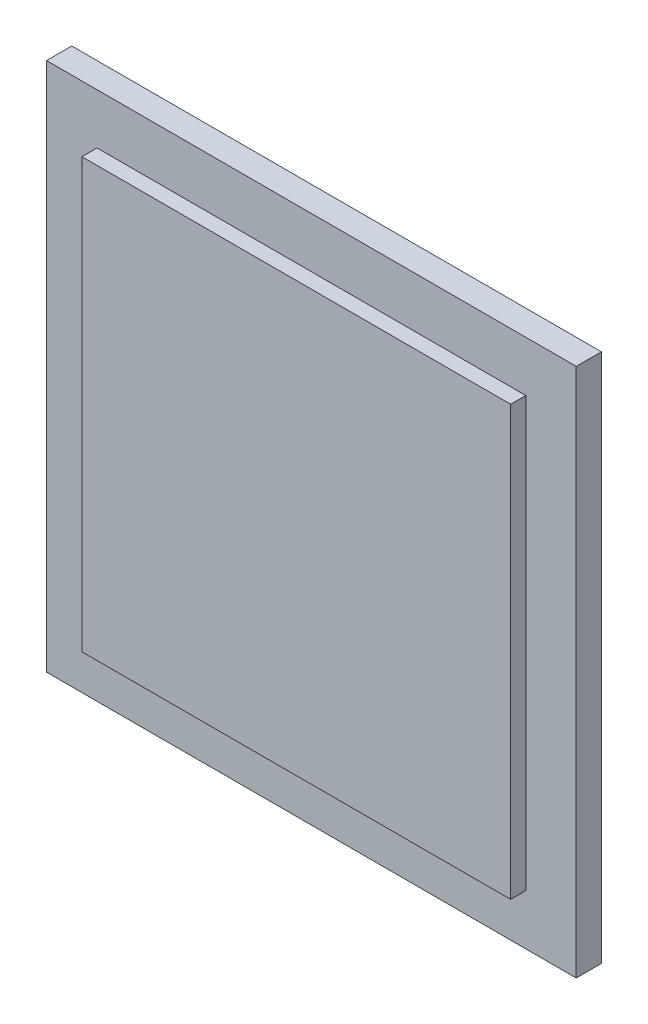
ISO-10303-21;
HEADER;
FILE_DESCRIPTION(('STEP AP214'),'2;1');
FILE_NAME('part.step','',(''),(''),'','','');
FILE_SCHEMA(('AUTOMOTIVE_DESIGN { 1 0 10303 214 1 1 1 1 }'));
ENDSEC;
DATA;
#1=APPLICATION_CONTEXT('core data for automotive mechanical design processes');
#2=APPLICATION_PROTOCOL_DEFINITION('international standard','automotive_design',2000,#1);
#3=PRODUCT_CONTEXT('',#1,'mechanical');
#4=PRODUCT('Part','Part','',(#3));
#5=PRODUCT_RELATED_PRODUCT_CATEGORY('part','',(#4));
#6=PRODUCT_DEFINITION_FORMATION('','',#4);
#7=PRODUCT_DEFINITION_CONTEXT('part definition',#1,'design');
#8=PRODUCT_DEFINITION('design','',#6,#7);
#9=PRODUCT_DEFINITION_SHAPE('','',#8);
#10=(LENGTH_UNIT() NAMED_UNIT(*) SI_UNIT(.MILLI.,.METRE.));
#11=(NAMED_UNIT(*) PLANE_ANGLE_UNIT() SI_UNIT($,.RADIAN.));
#12=(NAMED_UNIT(*) SI_UNIT($,.STERADIAN.) SOLID_ANGLE_UNIT());
#13=UNCERTAINTY_MEASURE_WITH_UNIT(LENGTH_MEASURE(1.E-05),#10,'distance_accuracy_value','');
#14=(GEOMETRIC_REPRESENTATION_CONTEXT(3) GLOBAL_UNCERTAINTY_ASSIGNED_CONTEXT((#13)) GLOBAL_UNIT_ASSIGNED_CONTEXT((#10,
#11,#12)) REPRESENTATION_CONTEXT('',''));
#15=CARTESIAN_POINT('',(0.,0.,0.));
#16=DIRECTION('',(0.,0.,1.));
#17=DIRECTION('',(1.,0.,0.));
#18=AXIS2_PLACEMENT_3D('',#15,#16,#17);
#19=CARTESIAN_POINT('',(-52.5,52.5,5.));
#20=DIRECTION('',(1.,0.,0.));
#21=DIRECTION('',(0.,1.,0.));
#22=AXIS2_PLACEMENT_3D('',#19,#20,#21);
#23=PLANE('',#22);
#24=DIRECTION('',(0.,-1.,0.));
#25=VECTOR('',#24,1.);
#26=CARTESIAN_POINT('',(-52.5,52.5,0.));
#27=LINE('',#26,#25);
#28=CARTESIAN_POINT('',(-52.5,52.5,0.));
#29=VERTEX_POINT('',#28);
#30=CARTESIAN_POINT('',(-52.5,-52.5,0.));
#31=VERTEX_POINT('',#30);
#32=EDGE_CURVE('E117',#29,#31,#27,.T.);
#33=ORIENTED_EDGE('',*,*,#32,.T.);
#34=DIRECTION('',(0.,0.,-1.));
#35=VECTOR('',#34,1.);
#36=CARTESIAN_POINT('',(-52.5,-52.5,5.));
#37=LINE('',#36,#35);
#38=CARTESIAN_POINT('',(-52.5,-52.5,5.));
#39=VERTEX_POINT('',#38);
#40=EDGE_CURVE('E11',#39,#31,#37,.T.);
#41=ORIENTED_EDGE('',*,*,#40,.F.);
#42=DIRECTION('',(0.,-1.,0.));
#43=VECTOR('',#42,1.);
#44=CARTESIAN_POINT('',(-52.5,52.5,5.));
#45=LINE('',#44,#43);
#46=CARTESIAN_POINT('',(-52.5,52.5,5.));
#47=VERTEX_POINT('',#46);
#48=EDGE_CURVE('E126',#47,#39,#45,.T.);
#49=ORIENTED_EDGE('',*,*,#48,.F.);
#50=DIRECTION('',(0.,0.,-1.));
#51=VECTOR('',#50,1.);
#52=CARTESIAN_POINT('',(-52.5,52.5,5.));
#53=LINE('',#52,#51);
#54=EDGE_CURVE('E137',#47,#29,#53,.T.);
#55=ORIENTED_EDGE('',*,*,#54,.T.);
#56=EDGE_LOOP('',(#33,#41,#49,#55));
#57=FACE_BOUND('',#56,.T.);
#58=ADVANCED_FACE('F33',(#57),#23,.F.);
#59=CARTESIAN_POINT('',(-52.5,-52.5,5.));
#60=DIRECTION('',(0.,1.,0.));
#61=DIRECTION('',(0.,0.,1.));
#62=AXIS2_PLACEMENT_3D('',#59,#60,#61);
#63=PLANE('',#62);
#64=DIRECTION('',(1.,0.,0.));
#65=VECTOR('',#64,1.);
#66=CARTESIAN_POINT('',(-52.5,-52.5,0.));
#67=LINE('',#66,#65);
#68=CARTESIAN_POINT('',(52.5,-52.5,0.));
#69=VERTEX_POINT('',#68);
#70=EDGE_CURVE('E120',#31,#69,#67,.T.);
#71=ORIENTED_EDGE('',*,*,#70,.T.);
#72=DIRECTION('',(0.,0.,-1.));
#73=VECTOR('',#72,1.);
#74=CARTESIAN_POINT('',(52.5,-52.5,5.));
#75=LINE('',#74,#73);
#76=CARTESIAN_POINT('',(52.5,-52.5,5.));
#77=VERTEX_POINT('',#76);
#78=EDGE_CURVE('E40',#77,#69,#75,.T.);
#79=ORIENTED_EDGE('',*,*,#78,.F.);
#80=DIRECTION('',(1.,0.,0.));
#81=VECTOR('',#80,1.);
#82=CARTESIAN_POINT('',(-52.5,-52.5,5.));
#83=LINE('',#82,#81);
#84=EDGE_CURVE('E129',#39,#77,#83,.T.);
#85=ORIENTED_EDGE('',*,*,#84,.F.);
#86=ORIENTED_EDGE('',*,*,#40,.T.);
#87=EDGE_LOOP('',(#71,#79,#85,#86));
#88=FACE_BOUND('',#87,.T.);
#89=ADVANCED_FACE('F154',(#88),#63,.F.);
#90=CARTESIAN_POINT('',(52.5,52.5,5.));
#91=DIRECTION('',(1.,0.,0.));
#92=DIRECTION('',(0.,1.,0.));
#93=AXIS2_PLACEMENT_3D('',#90,#91,#92);
#94=PLANE('',#93);
#95=DIRECTION('',(0.,-1.,0.));
#96=VECTOR('',#95,1.);
#97=CARTESIAN_POINT('',(52.5,52.5,0.));
#98=LINE('',#97,#96);
#99=CARTESIAN_POINT('',(52.5,52.5,0.));
#100=VERTEX_POINT('',#99);
#101=EDGE_CURVE('E141',#100,#69,#98,.T.);
#102=ORIENTED_EDGE('',*,*,#101,.F.);
#103=DIRECTION('',(0.,0.,-1.));
#104=VECTOR('',#103,1.);
#105=CARTESIAN_POINT('',(52.5,52.5,5.));
#106=LINE('',#105,#104);
#107=CARTESIAN_POINT('',(52.5,52.5,5.));
#108=VERTEX_POINT('',#107);
#109=EDGE_CURVE('E147',#108,#100,#106,.T.);
#110=ORIENTED_EDGE('',*,*,#109,.F.);
#111=DIRECTION('',(0.,-1.,0.));
#112=VECTOR('',#111,1.);
#113=CARTESIAN_POINT('',(52.5,52.5,5.));
#114=LINE('',#113,#112);
#115=EDGE_CURVE('E132',#108,#77,#114,.T.);
#116=ORIENTED_EDGE('',*,*,#115,.T.);
#117=ORIENTED_EDGE('',*,*,#78,.T.);
#118=EDGE_LOOP('',(#102,#110,#116,#117));
#119=FACE_BOUND('',#118,.T.);
#120=ADVANCED_FACE('F151',(#119),#94,.T.);
#121=CARTESIAN_POINT('',(-52.5,52.5,5.));
#122=DIRECTION('',(0.,1.,0.));
#123=DIRECTION('',(0.,0.,1.));
#124=AXIS2_PLACEMENT_3D('',#121,#122,#123);
#125=PLANE('',#124);
#126=DIRECTION('',(1.,0.,0.));
#127=VECTOR('',#126,1.);
#128=CARTESIAN_POINT('',(-52.5,52.5,0.));
#129=LINE('',#128,#127);
#130=EDGE_CURVE('E130',#29,#100,#129,.T.);
#131=ORIENTED_EDGE('',*,*,#130,.F.);
#132=ORIENTED_EDGE('',*,*,#54,.F.);
#133=DIRECTION('',(1.,0.,0.));
#134=VECTOR('',#133,1.);
#135=CARTESIAN_POINT('',(-52.5,52.5,5.));
#136=LINE('',#135,#134);
#137=EDGE_CURVE('E135',#47,#108,#136,.T.);
#138=ORIENTED_EDGE('',*,*,#137,.T.);
#139=ORIENTED_EDGE('',*,*,#109,.T.);
#140=EDGE_LOOP('',(#131,#132,#138,#139));
#141=FACE_BOUND('',#140,.T.);
#142=ADVANCED_FACE('F161',(#141),#125,.T.);
#143=CARTESIAN_POINT('',(0.,0.,5.));
#144=DIRECTION('',(0.,0.,1.));
#145=DIRECTION('',(1.,0.,0.));
#146=AXIS2_PLACEMENT_3D('',#143,#144,#145);
#147=PLANE('',#146);
#148=DIRECTION('',(0.,1.,0.));
#149=VECTOR('',#148,1.);
#150=CARTESIAN_POINT('',(42.5,42.5,5.));
#151=LINE('',#150,#149);
#152=CARTESIAN_POINT('',(42.5,-42.5,5.));
#153=VERTEX_POINT('',#152);
#154=CARTESIAN_POINT('',(42.5,42.5,5.));
#155=VERTEX_POINT('',#154);
#156=EDGE_CURVE('E47',#153,#155,#151,.T.);
#157=ORIENTED_EDGE('',*,*,#156,.F.);
#158=DIRECTION('',(1.,0.,0.));
#159=VECTOR('',#158,1.);
#160=CARTESIAN_POINT('',(-42.5,-42.5,5.));
#161=LINE('',#160,#159);
#162=CARTESIAN_POINT('',(-42.5,-42.5,5.));
#163=VERTEX_POINT('',#162);
#164=EDGE_CURVE('E51',#163,#153,#161,.T.);
#165=ORIENTED_EDGE('',*,*,#164,.F.);
#166=DIRECTION('',(0.,-1.,0.));
#167=VECTOR('',#166,1.);
#168=CARTESIAN_POINT('',(-42.5,42.5,5.));
#169=LINE('',#168,#167);
#170=CARTESIAN_POINT('',(-42.5,42.5,5.));
#171=VERTEX_POINT('',#170);
#172=EDGE_CURVE('E260',#171,#163,#169,.T.);
#173=ORIENTED_EDGE('',*,*,#172,.F.);
#174=DIRECTION('',(-1.,0.,0.));
#175=VECTOR('',#174,1.);
#176=CARTESIAN_POINT('',(-42.5,42.5,5.));
#177=LINE('',#176,#175);
#178=EDGE_CURVE('E266',#155,#171,#177,.T.);
#179=ORIENTED_EDGE('',*,*,#178,.F.);
#180=EDGE_LOOP('',(#157,#165,#173,#179));
#181=FACE_BOUND('',#180,.T.);
#182=ORIENTED_EDGE('',*,*,#48,.T.);
#183=ORIENTED_EDGE('',*,*,#84,.T.);
#184=ORIENTED_EDGE('',*,*,#115,.F.);
#185=ORIENTED_EDGE('',*,*,#137,.F.);
#186=EDGE_LOOP('',(#182,#183,#184,#185));
#187=FACE_BOUND('',#186,.T.);
#188=ADVANCED_FACE('F165',(#181,#187),#147,.T.);
#189=CARTESIAN_POINT('',(0.,0.,0.));
#190=DIRECTION('',(0.,0.,1.));
#191=DIRECTION('',(1.,0.,0.));
#192=AXIS2_PLACEMENT_3D('',#189,#190,#191);
#193=PLANE('',#192);
#194=ORIENTED_EDGE('',*,*,#32,.F.);
#195=ORIENTED_EDGE('',*,*,#130,.T.);
#196=ORIENTED_EDGE('',*,*,#101,.T.);
#197=ORIENTED_EDGE('',*,*,#70,.F.);
#198=EDGE_LOOP('',(#194,#195,#196,#197));
#199=FACE_BOUND('',#198,.T.);
#200=ADVANCED_FACE('F158',(#199),#193,.F.);
#201=CARTESIAN_POINT('',(42.5,42.5,8.));
#202=DIRECTION('',(-1.,0.,0.));
#203=DIRECTION('',(0.,-1.,0.));
#204=AXIS2_PLACEMENT_3D('',#201,#202,#203);
#205=PLANE('',#204);
#206=ORIENTED_EDGE('',*,*,#156,.T.);
#207=DIRECTION('',(0.,0.,-1.));
#208=VECTOR('',#207,1.);
#209=CARTESIAN_POINT('',(42.5,42.5,8.));
#210=LINE('',#209,#208);
#211=CARTESIAN_POINT('',(42.5,42.5,8.));
#212=VERTEX_POINT('',#211);
#213=EDGE_CURVE('E100',#212,#155,#210,.T.);
#214=ORIENTED_EDGE('',*,*,#213,.F.);
#215=DIRECTION('',(0.,1.,0.));
#216=VECTOR('',#215,1.);
#217=CARTESIAN_POINT('',(42.5,42.5,8.));
#218=LINE('',#217,#216);
#219=CARTESIAN_POINT('',(42.5,-42.5,8.));
#220=VERTEX_POINT('',#219);
#221=EDGE_CURVE('E106',#220,#212,#218,.T.);
#222=ORIENTED_EDGE('',*,*,#221,.F.);
#223=DIRECTION('',(0.,0.,-1.));
#224=VECTOR('',#223,1.);
#225=CARTESIAN_POINT('',(42.5,-42.5,8.));
#226=LINE('',#225,#224);
#227=EDGE_CURVE('E258',#220,#153,#226,.T.);
#228=ORIENTED_EDGE('',*,*,#227,.T.);
#229=EDGE_LOOP('',(#206,#214,#222,#228));
#230=FACE_BOUND('',#229,.T.);
#231=ADVANCED_FACE('F116',(#230),#205,.F.);
#232=CARTESIAN_POINT('',(-42.5,42.5,8.));
#233=DIRECTION('',(0.,-1.,0.));
#234=DIRECTION('',(0.,0.,-1.));
#235=AXIS2_PLACEMENT_3D('',#232,#233,#234);
#236=PLANE('',#235);
#237=ORIENTED_EDGE('',*,*,#178,.T.);
#238=DIRECTION('',(0.,0.,-1.));
#239=VECTOR('',#238,1.);
#240=CARTESIAN_POINT('',(-42.5,42.5,8.));
#241=LINE('',#240,#239);
#242=CARTESIAN_POINT('',(-42.5,42.5,8.));
#243=VERTEX_POINT('',#242);
#244=EDGE_CURVE('E102',#243,#171,#241,.T.);
#245=ORIENTED_EDGE('',*,*,#244,.F.);
#246=DIRECTION('',(-1.,0.,0.));
#247=VECTOR('',#246,1.);
#248=CARTESIAN_POINT('',(-42.5,42.5,8.));
#249=LINE('',#248,#247);
#250=EDGE_CURVE('E95',#212,#243,#249,.T.);
#251=ORIENTED_EDGE('',*,*,#250,.F.);
#252=ORIENTED_EDGE('',*,*,#213,.T.);
#253=EDGE_LOOP('',(#237,#245,#251,#252));
#254=FACE_BOUND('',#253,.T.);
#255=ADVANCED_FACE('F98',(#254),#236,.F.);
#256=CARTESIAN_POINT('',(-42.5,42.5,8.));
#257=DIRECTION('',(1.,0.,0.));
#258=DIRECTION('',(0.,1.,0.));
#259=AXIS2_PLACEMENT_3D('',#256,#257,#258);
#260=PLANE('',#259);
#261=ORIENTED_EDGE('',*,*,#172,.T.);
#262=DIRECTION('',(0.,0.,-1.));
#263=VECTOR('',#262,1.);
#264=CARTESIAN_POINT('',(-42.5,-42.5,8.));
#265=LINE('',#264,#263);
#266=CARTESIAN_POINT('',(-42.5,-42.5,8.));
#267=VERTEX_POINT('',#266);
#268=EDGE_CURVE('E122',#267,#163,#265,.T.);
#269=ORIENTED_EDGE('',*,*,#268,.F.);
#270=DIRECTION('',(0.,-1.,0.));
#271=VECTOR('',#270,1.);
#272=CARTESIAN_POINT('',(-42.5,42.5,8.));
#273=LINE('',#272,#271);
#274=EDGE_CURVE('E105',#243,#267,#273,.T.);
#275=ORIENTED_EDGE('',*,*,#274,.F.);
#276=ORIENTED_EDGE('',*,*,#244,.T.);
#277=EDGE_LOOP('',(#261,#269,#275,#276));
#278=FACE_BOUND('',#277,.T.);
#279=ADVANCED_FACE('F186',(#278),#260,.F.);
#280=CARTESIAN_POINT('',(-42.5,-42.5,8.));
#281=DIRECTION('',(0.,1.,0.));
#282=DIRECTION('',(0.,0.,1.));
#283=AXIS2_PLACEMENT_3D('',#280,#281,#282);
#284=PLANE('',#283);
#285=ORIENTED_EDGE('',*,*,#164,.T.);
#286=ORIENTED_EDGE('',*,*,#227,.F.);
#287=DIRECTION('',(1.,0.,0.));
#288=VECTOR('',#287,1.);
#289=CARTESIAN_POINT('',(-42.5,-42.5,8.));
#290=LINE('',#289,#288);
#291=EDGE_CURVE('E111',#267,#220,#290,.T.);
#292=ORIENTED_EDGE('',*,*,#291,.F.);
#293=ORIENTED_EDGE('',*,*,#268,.T.);
#294=EDGE_LOOP('',(#285,#286,#292,#293));
#295=FACE_BOUND('',#294,.T.);
#296=ADVANCED_FACE('F189',(#295),#284,.F.);
#297=CARTESIAN_POINT('',(0.,0.,8.));
#298=DIRECTION('',(0.,0.,1.));
#299=DIRECTION('',(1.,0.,0.));
#300=AXIS2_PLACEMENT_3D('',#297,#298,#299);
#301=PLANE('',#300);
#302=ORIENTED_EDGE('',*,*,#221,.T.);
#303=ORIENTED_EDGE('',*,*,#250,.T.);
#304=ORIENTED_EDGE('',*,*,#274,.T.);
#305=ORIENTED_EDGE('',*,*,#291,.T.);
#306=EDGE_LOOP('',(#302,#303,#304,#305));
#307=FACE_BOUND('',#306,.T.);
#308=ADVANCED_FACE('F109',(#307),#301,.T.);
#309=CLOSED_SHELL('',(#58,#89,#120,#142,#188,#200,#231,#255,#279,#296,#308));
#310=MANIFOLD_SOLID_BREP('B2',#309);
#311=ADVANCED_BREP_SHAPE_REPRESENTATION('',(#18,#310),#14);
#312=SHAPE_DEFINITION_REPRESENTATION(#9,#311);
ENDSEC;
END-ISO-10303-21;
